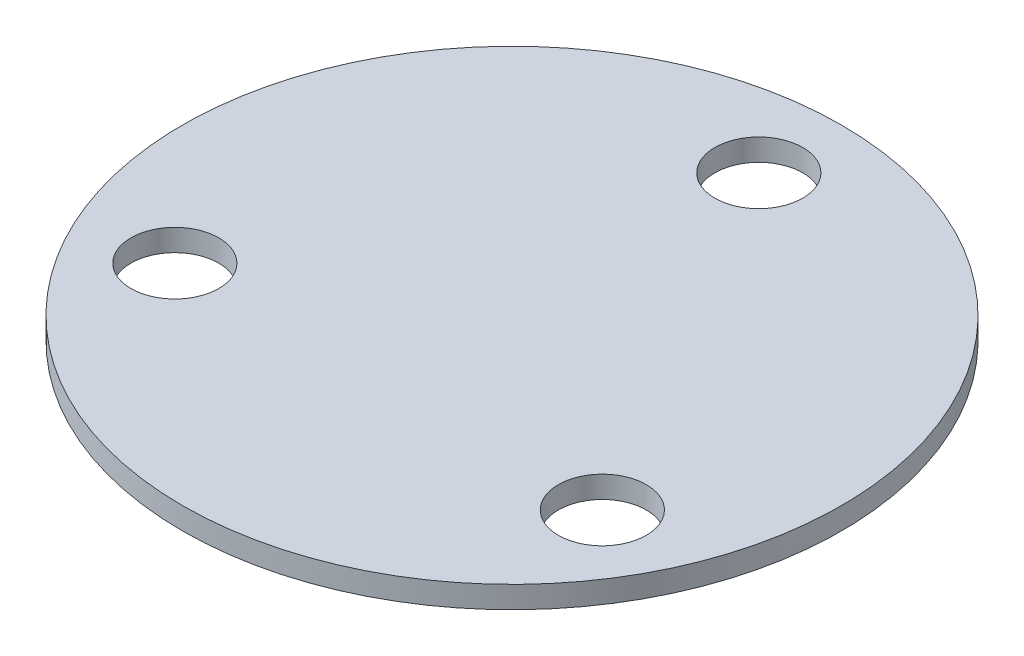
ISO-10303-21;
HEADER;
FILE_DESCRIPTION(('STEP AP214'),'2;1');
FILE_NAME('part.step','',(''),(''),'','','');
FILE_SCHEMA(('AUTOMOTIVE_DESIGN { 1 0 10303 214 1 1 1 1 }'));
ENDSEC;
DATA;
#1=APPLICATION_CONTEXT('core data for automotive mechanical design processes');
#2=APPLICATION_PROTOCOL_DEFINITION('international standard','automotive_design',2000,#1);
#3=PRODUCT_CONTEXT('',#1,'mechanical');
#4=PRODUCT('Part','Part','',(#3));
#5=PRODUCT_RELATED_PRODUCT_CATEGORY('part','',(#4));
#6=PRODUCT_DEFINITION_FORMATION('','',#4);
#7=PRODUCT_DEFINITION_CONTEXT('part definition',#1,'design');
#8=PRODUCT_DEFINITION('design','',#6,#7);
#9=PRODUCT_DEFINITION_SHAPE('','',#8);
#10=(LENGTH_UNIT() NAMED_UNIT(*) SI_UNIT(.MILLI.,.METRE.));
#11=(NAMED_UNIT(*) PLANE_ANGLE_UNIT() SI_UNIT($,.RADIAN.));
#12=(NAMED_UNIT(*) SI_UNIT($,.STERADIAN.) SOLID_ANGLE_UNIT());
#13=UNCERTAINTY_MEASURE_WITH_UNIT(LENGTH_MEASURE(1.E-05),#10,'distance_accuracy_value','');
#14=(GEOMETRIC_REPRESENTATION_CONTEXT(3) GLOBAL_UNCERTAINTY_ASSIGNED_CONTEXT((#13)) GLOBAL_UNIT_ASSIGNED_CONTEXT((#10,
#11,#12)) REPRESENTATION_CONTEXT('',''));
#15=CARTESIAN_POINT('',(0.,0.,0.));
#16=DIRECTION('',(0.,0.,1.));
#17=DIRECTION('',(1.,0.,0.));
#18=AXIS2_PLACEMENT_3D('',#15,#16,#17);
#19=CARTESIAN_POINT('',(0.,5.,0.));
#20=DIRECTION('',(0.,-1.,0.));
#21=DIRECTION('',(0.,0.,-1.));
#22=AXIS2_PLACEMENT_3D('',#19,#20,#21);
#23=CYLINDRICAL_SURFACE('',#22,75.);
#24=CARTESIAN_POINT('',(0.,5.,0.));
#25=DIRECTION('',(0.,1.,0.));
#26=DIRECTION('',(0.,0.,1.));
#27=AXIS2_PLACEMENT_3D('',#24,#25,#26);
#28=CIRCLE('',#27,75.);
#29=CARTESIAN_POINT('',(0.,5.,75.));
#30=VERTEX_POINT('',#29);
#31=EDGE_CURVE('E10',#30,#30,#28,.T.);
#32=ORIENTED_EDGE('',*,*,#31,.F.);
#33=EDGE_LOOP('',(#32));
#34=FACE_BOUND('',#33,.T.);
#35=CARTESIAN_POINT('',(0.,0.,0.));
#36=DIRECTION('',(0.,1.,0.));
#37=DIRECTION('',(0.,0.,1.));
#38=AXIS2_PLACEMENT_3D('',#35,#36,#37);
#39=CIRCLE('',#38,75.);
#40=CARTESIAN_POINT('',(0.,0.,75.));
#41=VERTEX_POINT('',#40);
#42=EDGE_CURVE('E34',#41,#41,#39,.T.);
#43=ORIENTED_EDGE('',*,*,#42,.T.);
#44=EDGE_LOOP('',(#43));
#45=FACE_BOUND('',#44,.T.);
#46=ADVANCED_FACE('F31',(#34,#45),#23,.T.);
#47=CARTESIAN_POINT('',(0.,5.,0.));
#48=DIRECTION('',(0.,1.,0.));
#49=DIRECTION('',(0.,0.,1.));
#50=AXIS2_PLACEMENT_3D('',#47,#48,#49);
#51=PLANE('',#50);
#52=CARTESIAN_POINT('',(3.89909341055567E-12,5.,-56.1685165579006));
#53=DIRECTION('',(0.,1.,0.));
#54=DIRECTION('',(0.,0.,1.));
#55=AXIS2_PLACEMENT_3D('',#52,#53,#54);
#56=CIRCLE('',#55,9.99999999999688);
#57=CARTESIAN_POINT('',(3.89909341055567E-12,5.,-46.1685165579037));
#58=VERTEX_POINT('',#57);
#59=EDGE_CURVE('E55',#58,#58,#56,.T.);
#60=ORIENTED_EDGE('',*,*,#59,.F.);
#61=EDGE_LOOP('',(#60));
#62=FACE_BOUND('',#61,.T.);
#63=CARTESIAN_POINT('',(48.6433622320304,5.,28.0842582789515));
#64=DIRECTION('',(0.,1.,0.));
#65=DIRECTION('',(0.,0.,1.));
#66=AXIS2_PLACEMENT_3D('',#63,#64,#65);
#67=CIRCLE('',#66,10.);
#68=CARTESIAN_POINT('',(48.6433622320304,5.,38.0842582789516));
#69=VERTEX_POINT('',#68);
#70=EDGE_CURVE('E49',#69,#69,#67,.T.);
#71=ORIENTED_EDGE('',*,*,#70,.F.);
#72=EDGE_LOOP('',(#71));
#73=FACE_BOUND('',#72,.T.);
#74=CARTESIAN_POINT('',(-48.6433622320271,5.,28.084258278949));
#75=DIRECTION('',(0.,1.,0.));
#76=DIRECTION('',(0.,0.,1.));
#77=AXIS2_PLACEMENT_3D('',#74,#75,#76);
#78=CIRCLE('',#77,10.0000000000014);
#79=CARTESIAN_POINT('',(-48.6433622320271,5.,38.0842582789504));
#80=VERTEX_POINT('',#79);
#81=EDGE_CURVE('E43',#80,#80,#78,.T.);
#82=ORIENTED_EDGE('',*,*,#81,.F.);
#83=EDGE_LOOP('',(#82));
#84=FACE_BOUND('',#83,.T.);
#85=ORIENTED_EDGE('',*,*,#31,.T.);
#86=EDGE_LOOP('',(#85));
#87=FACE_BOUND('',#86,.T.);
#88=ADVANCED_FACE('F71',(#62,#73,#84,#87),#51,.T.);
#89=CARTESIAN_POINT('',(0.,0.,0.));
#90=DIRECTION('',(0.,1.,0.));
#91=DIRECTION('',(0.,0.,1.));
#92=AXIS2_PLACEMENT_3D('',#89,#90,#91);
#93=PLANE('',#92);
#94=CARTESIAN_POINT('',(3.89909341055567E-12,0.,-56.1685165579006));
#95=DIRECTION('',(0.,1.,0.));
#96=DIRECTION('',(0.,0.,1.));
#97=AXIS2_PLACEMENT_3D('',#94,#95,#96);
#98=CIRCLE('',#97,9.99999999999688);
#99=CARTESIAN_POINT('',(3.89909341055567E-12,0.,-46.1685165579037));
#100=VERTEX_POINT('',#99);
#101=EDGE_CURVE('E41',#100,#100,#98,.T.);
#102=ORIENTED_EDGE('',*,*,#101,.T.);
#103=EDGE_LOOP('',(#102));
#104=FACE_BOUND('',#103,.T.);
#105=CARTESIAN_POINT('',(48.6433622320304,0.,28.0842582789515));
#106=DIRECTION('',(0.,1.,0.));
#107=DIRECTION('',(0.,0.,1.));
#108=AXIS2_PLACEMENT_3D('',#105,#106,#107);
#109=CIRCLE('',#108,10.);
#110=CARTESIAN_POINT('',(48.6433622320304,0.,38.0842582789516));
#111=VERTEX_POINT('',#110);
#112=EDGE_CURVE('E52',#111,#111,#109,.T.);
#113=ORIENTED_EDGE('',*,*,#112,.T.);
#114=EDGE_LOOP('',(#113));
#115=FACE_BOUND('',#114,.T.);
#116=CARTESIAN_POINT('',(-48.6433622320271,0.,28.084258278949));
#117=DIRECTION('',(0.,1.,0.));
#118=DIRECTION('',(0.,0.,1.));
#119=AXIS2_PLACEMENT_3D('',#116,#117,#118);
#120=CIRCLE('',#119,10.0000000000014);
#121=CARTESIAN_POINT('',(-48.6433622320271,0.,38.0842582789504));
#122=VERTEX_POINT('',#121);
#123=EDGE_CURVE('E46',#122,#122,#120,.T.);
#124=ORIENTED_EDGE('',*,*,#123,.T.);
#125=EDGE_LOOP('',(#124));
#126=FACE_BOUND('',#125,.T.);
#127=ORIENTED_EDGE('',*,*,#42,.F.);
#128=EDGE_LOOP('',(#127));
#129=FACE_BOUND('',#128,.T.);
#130=ADVANCED_FACE('F61',(#104,#115,#126,#129),#93,.F.);
#131=CARTESIAN_POINT('',(-48.6433622320271,0.,28.084258278949));
#132=DIRECTION('',(0.,1.,0.));
#133=DIRECTION('',(0.,0.,1.));
#134=AXIS2_PLACEMENT_3D('',#131,#132,#133);
#135=CYLINDRICAL_SURFACE('',#134,10.0000000000014);
#136=ORIENTED_EDGE('',*,*,#123,.F.);
#137=EDGE_LOOP('',(#136));
#138=FACE_BOUND('',#137,.T.);
#139=ORIENTED_EDGE('',*,*,#81,.T.);
#140=EDGE_LOOP('',(#139));
#141=FACE_BOUND('',#140,.T.);
#142=ADVANCED_FACE('F79',(#138,#141),#135,.F.);
#143=CARTESIAN_POINT('',(48.6433622320304,0.,28.0842582789515));
#144=DIRECTION('',(0.,1.,0.));
#145=DIRECTION('',(0.,0.,1.));
#146=AXIS2_PLACEMENT_3D('',#143,#144,#145);
#147=CYLINDRICAL_SURFACE('',#146,10.);
#148=ORIENTED_EDGE('',*,*,#112,.F.);
#149=EDGE_LOOP('',(#148));
#150=FACE_BOUND('',#149,.T.);
#151=ORIENTED_EDGE('',*,*,#70,.T.);
#152=EDGE_LOOP('',(#151));
#153=FACE_BOUND('',#152,.T.);
#154=ADVANCED_FACE('F67',(#150,#153),#147,.F.);
#155=CARTESIAN_POINT('',(3.89909341055567E-12,0.,-56.1685165579006));
#156=DIRECTION('',(0.,1.,0.));
#157=DIRECTION('',(0.,0.,1.));
#158=AXIS2_PLACEMENT_3D('',#155,#156,#157);
#159=CYLINDRICAL_SURFACE('',#158,9.99999999999688);
#160=ORIENTED_EDGE('',*,*,#101,.F.);
#161=EDGE_LOOP('',(#160));
#162=FACE_BOUND('',#161,.T.);
#163=ORIENTED_EDGE('',*,*,#59,.T.);
#164=EDGE_LOOP('',(#163));
#165=FACE_BOUND('',#164,.T.);
#166=ADVANCED_FACE('F64',(#162,#165),#159,.F.);
#167=CLOSED_SHELL('',(#46,#88,#130,#142,#154,#166));
#168=MANIFOLD_SOLID_BREP('B2',#167);
#169=ADVANCED_BREP_SHAPE_REPRESENTATION('',(#18,#168),#14);
#170=SHAPE_DEFINITION_REPRESENTATION(#9,#169);
ENDSEC;
END-ISO-10303-21;
